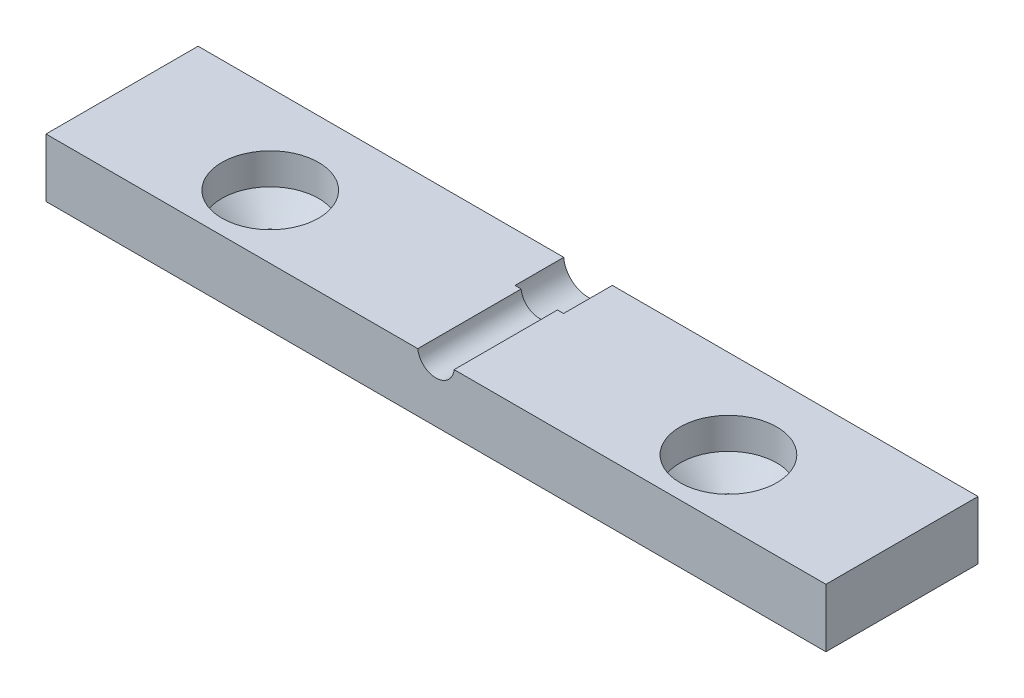
ISO-10303-21;
HEADER;
FILE_DESCRIPTION(('STEP AP214'),'2;1');
FILE_NAME('part.step','',(''),(''),'','','');
FILE_SCHEMA(('AUTOMOTIVE_DESIGN { 1 0 10303 214 1 1 1 1 }'));
ENDSEC;
DATA;
#1=APPLICATION_CONTEXT('core data for automotive mechanical design processes');
#2=APPLICATION_PROTOCOL_DEFINITION('international standard','automotive_design',2000,#1);
#3=PRODUCT_CONTEXT('',#1,'mechanical');
#4=PRODUCT('Part','Part','',(#3));
#5=PRODUCT_RELATED_PRODUCT_CATEGORY('part','',(#4));
#6=PRODUCT_DEFINITION_FORMATION('','',#4);
#7=PRODUCT_DEFINITION_CONTEXT('part definition',#1,'design');
#8=PRODUCT_DEFINITION('design','',#6,#7);
#9=PRODUCT_DEFINITION_SHAPE('','',#8);
#10=(LENGTH_UNIT() NAMED_UNIT(*) SI_UNIT(.MILLI.,.METRE.));
#11=(NAMED_UNIT(*) PLANE_ANGLE_UNIT() SI_UNIT($,.RADIAN.));
#12=(NAMED_UNIT(*) SI_UNIT($,.STERADIAN.) SOLID_ANGLE_UNIT());
#13=UNCERTAINTY_MEASURE_WITH_UNIT(LENGTH_MEASURE(1.E-05),#10,'distance_accuracy_value','');
#14=(GEOMETRIC_REPRESENTATION_CONTEXT(3) GLOBAL_UNCERTAINTY_ASSIGNED_CONTEXT((#13)) GLOBAL_UNIT_ASSIGNED_CONTEXT((#10,
#11,#12)) REPRESENTATION_CONTEXT('',''));
#15=CARTESIAN_POINT('',(0.,0.,0.));
#16=DIRECTION('',(0.,0.,1.));
#17=DIRECTION('',(1.,0.,0.));
#18=AXIS2_PLACEMENT_3D('',#15,#16,#17);
#19=CARTESIAN_POINT('',(0.,7.62,0.));
#20=DIRECTION('',(0.,1.,0.));
#21=DIRECTION('',(0.,0.,1.));
#22=AXIS2_PLACEMENT_3D('',#19,#20,#21);
#23=PLANE('',#22);
#24=DIRECTION('',(0.,0.,-1.));
#25=VECTOR('',#24,1.);
#26=CARTESIAN_POINT('',(2.36766457981277,7.62,9.90600000000001));
#27=LINE('',#26,#25);
#28=CARTESIAN_POINT('',(2.36766457981277,7.62,9.90600000000001));
#29=VERTEX_POINT('',#28);
#30=CARTESIAN_POINT('',(2.36766457981277,7.62,-3.556));
#31=VERTEX_POINT('',#30);
#32=EDGE_CURVE('E49',#29,#31,#27,.T.);
#33=ORIENTED_EDGE('',*,*,#32,.F.);
#34=DIRECTION('',(1.,0.,0.));
#35=VECTOR('',#34,1.);
#36=CARTESIAN_POINT('',(-50.8,7.62,9.90600000000001));
#37=LINE('',#36,#35);
#38=CARTESIAN_POINT('',(50.8,7.62000000000003,9.90599999999999));
#39=VERTEX_POINT('',#38);
#40=EDGE_CURVE('E111',#29,#39,#37,.T.);
#41=ORIENTED_EDGE('',*,*,#40,.T.);
#42=DIRECTION('',(0.,0.,-1.));
#43=VECTOR('',#42,1.);
#44=CARTESIAN_POINT('',(50.8,7.62,9.90599999999999));
#45=LINE('',#44,#43);
#46=CARTESIAN_POINT('',(50.8,7.62,-9.906));
#47=VERTEX_POINT('',#46);
#48=EDGE_CURVE('E122',#39,#47,#45,.T.);
#49=ORIENTED_EDGE('',*,*,#48,.T.);
#50=DIRECTION('',(-1.,0.,0.));
#51=VECTOR('',#50,1.);
#52=CARTESIAN_POINT('',(50.8,7.62,-9.90600000000001));
#53=LINE('',#52,#51);
#54=CARTESIAN_POINT('',(3.16482369177179,7.62,-9.906));
#55=VERTEX_POINT('',#54);
#56=EDGE_CURVE('E132',#47,#55,#53,.T.);
#57=ORIENTED_EDGE('',*,*,#56,.T.);
#58=DIRECTION('',(0.,0.,-1.));
#59=VECTOR('',#58,1.);
#60=CARTESIAN_POINT('',(3.16482369177179,7.62,-3.556));
#61=LINE('',#60,#59);
#62=CARTESIAN_POINT('',(3.16482369177179,7.62,-3.556));
#63=VERTEX_POINT('',#62);
#64=EDGE_CURVE('E43',#63,#55,#61,.T.);
#65=ORIENTED_EDGE('',*,*,#64,.F.);
#66=DIRECTION('',(-1.,0.,0.));
#67=VECTOR('',#66,1.);
#68=CARTESIAN_POINT('',(0.,7.62,-3.556));
#69=LINE('',#68,#67);
#70=EDGE_CURVE('E114',#63,#31,#69,.T.);
#71=ORIENTED_EDGE('',*,*,#70,.T.);
#72=EDGE_LOOP('',(#33,#41,#49,#57,#65,#71));
#73=FACE_BOUND('',#72,.T.);
#74=CARTESIAN_POINT('',(29.845,7.62,1.651));
#75=DIRECTION('',(0.,1.,0.));
#76=DIRECTION('',(0.,0.,1.));
#77=AXIS2_PLACEMENT_3D('',#74,#75,#76);
#78=CIRCLE('',#77,6.29999999999999);
#79=CARTESIAN_POINT('',(29.845,7.62,7.95099999999999));
#80=VERTEX_POINT('',#79);
#81=EDGE_CURVE('E136',#80,#80,#78,.T.);
#82=ORIENTED_EDGE('',*,*,#81,.F.);
#83=EDGE_LOOP('',(#82));
#84=FACE_BOUND('',#83,.T.);
#85=ADVANCED_FACE('F35',(#73,#84),#23,.T.);
#86=CARTESIAN_POINT('',(-50.8,3.81,9.90600000000001));
#87=DIRECTION('',(1.,0.,0.));
#88=DIRECTION('',(0.,0.,-1.));
#89=AXIS2_PLACEMENT_3D('',#86,#87,#88);
#90=PLANE('',#89);
#91=DIRECTION('',(0.,0.,1.));
#92=VECTOR('',#91,1.);
#93=CARTESIAN_POINT('',(-50.8,0.,9.90600000000001));
#94=LINE('',#93,#92);
#95=CARTESIAN_POINT('',(-50.8,0.,-9.906));
#96=VERTEX_POINT('',#95);
#97=CARTESIAN_POINT('',(-50.8,0.,9.90600000000001));
#98=VERTEX_POINT('',#97);
#99=EDGE_CURVE('E157',#96,#98,#94,.T.);
#100=ORIENTED_EDGE('',*,*,#99,.T.);
#101=DIRECTION('',(0.,-1.,0.));
#102=VECTOR('',#101,1.);
#103=CARTESIAN_POINT('',(-50.8,3.81,9.90600000000001));
#104=LINE('',#103,#102);
#105=CARTESIAN_POINT('',(-50.8,7.62000000000003,9.90600000000001));
#106=VERTEX_POINT('',#105);
#107=EDGE_CURVE('E173',#106,#98,#104,.T.);
#108=ORIENTED_EDGE('',*,*,#107,.F.);
#109=DIRECTION('',(0.,0.,1.));
#110=VECTOR('',#109,1.);
#111=CARTESIAN_POINT('',(-50.8,7.62,-9.906));
#112=LINE('',#111,#110);
#113=CARTESIAN_POINT('',(-50.8,7.62000000000003,-9.906));
#114=VERTEX_POINT('',#113);
#115=EDGE_CURVE('E124',#114,#106,#112,.T.);
#116=ORIENTED_EDGE('',*,*,#115,.F.);
#117=DIRECTION('',(0.,-1.,0.));
#118=VECTOR('',#117,1.);
#119=CARTESIAN_POINT('',(-50.8,3.81,-9.906));
#120=LINE('',#119,#118);
#121=EDGE_CURVE('E166',#114,#96,#120,.T.);
#122=ORIENTED_EDGE('',*,*,#121,.T.);
#123=EDGE_LOOP('',(#100,#108,#116,#122));
#124=FACE_BOUND('',#123,.T.);
#125=ADVANCED_FACE('F37',(#124),#90,.F.);
#126=CARTESIAN_POINT('',(50.8,3.81,9.90599999999999));
#127=DIRECTION('',(0.,0.,-1.));
#128=DIRECTION('',(-1.,0.,0.));
#129=AXIS2_PLACEMENT_3D('',#126,#127,#128);
#130=PLANE('',#129);
#131=ORIENTED_EDGE('',*,*,#40,.F.);
#132=CARTESIAN_POINT('',(0.,7.874,9.90600000000001));
#133=DIRECTION('',(0.,0.,-1.));
#134=DIRECTION('',(-1.,0.,0.));
#135=AXIS2_PLACEMENT_3D('',#132,#133,#134);
#136=CIRCLE('',#135,2.38125);
#137=CARTESIAN_POINT('',(-2.36766457981277,7.62,9.90600000000001));
#138=VERTEX_POINT('',#137);
#139=EDGE_CURVE('E99',#29,#138,#136,.T.);
#140=ORIENTED_EDGE('',*,*,#139,.T.);
#141=EDGE_CURVE('E121',#106,#138,#37,.T.);
#142=ORIENTED_EDGE('',*,*,#141,.F.);
#143=ORIENTED_EDGE('',*,*,#107,.T.);
#144=DIRECTION('',(1.,0.,0.));
#145=VECTOR('',#144,1.);
#146=CARTESIAN_POINT('',(50.8,0.,9.90599999999999));
#147=LINE('',#146,#145);
#148=CARTESIAN_POINT('',(50.8,0.,9.90599999999999));
#149=VERTEX_POINT('',#148);
#150=EDGE_CURVE('E160',#98,#149,#147,.T.);
#151=ORIENTED_EDGE('',*,*,#150,.T.);
#152=DIRECTION('',(0.,-1.,0.));
#153=VECTOR('',#152,1.);
#154=CARTESIAN_POINT('',(50.8,3.81,9.90599999999999));
#155=LINE('',#154,#153);
#156=EDGE_CURVE('E119',#39,#149,#155,.T.);
#157=ORIENTED_EDGE('',*,*,#156,.F.);
#158=EDGE_LOOP('',(#131,#140,#142,#143,#151,#157));
#159=FACE_BOUND('',#158,.T.);
#160=ADVANCED_FACE('F117',(#159),#130,.F.);
#161=CARTESIAN_POINT('',(50.8,3.81,9.90599999999999));
#162=DIRECTION('',(-1.,0.,0.));
#163=DIRECTION('',(0.,0.,1.));
#164=AXIS2_PLACEMENT_3D('',#161,#162,#163);
#165=PLANE('',#164);
#166=DIRECTION('',(0.,0.,-1.));
#167=VECTOR('',#166,1.);
#168=CARTESIAN_POINT('',(50.8,0.,9.90599999999999));
#169=LINE('',#168,#167);
#170=CARTESIAN_POINT('',(50.8,0.,-9.90600000000001));
#171=VERTEX_POINT('',#170);
#172=EDGE_CURVE('E162',#149,#171,#169,.T.);
#173=ORIENTED_EDGE('',*,*,#172,.T.);
#174=DIRECTION('',(0.,-1.,0.));
#175=VECTOR('',#174,1.);
#176=CARTESIAN_POINT('',(50.8,3.81,-9.90600000000001));
#177=LINE('',#176,#175);
#178=EDGE_CURVE('E169',#47,#171,#177,.T.);
#179=ORIENTED_EDGE('',*,*,#178,.F.);
#180=ORIENTED_EDGE('',*,*,#48,.F.);
#181=ORIENTED_EDGE('',*,*,#156,.T.);
#182=EDGE_LOOP('',(#173,#179,#180,#181));
#183=FACE_BOUND('',#182,.T.);
#184=ADVANCED_FACE('F190',(#183),#165,.F.);
#185=CARTESIAN_POINT('',(50.8,3.81,-9.90600000000001));
#186=DIRECTION('',(0.,0.,1.));
#187=DIRECTION('',(1.,0.,0.));
#188=AXIS2_PLACEMENT_3D('',#185,#186,#187);
#189=PLANE('',#188);
#190=CARTESIAN_POINT('',(-3.16482369177179,7.62,-9.906));
#191=VERTEX_POINT('',#190);
#192=EDGE_CURVE('E131',#191,#114,#53,.T.);
#193=ORIENTED_EDGE('',*,*,#192,.F.);
#194=CARTESIAN_POINT('',(0.,7.874,-9.906));
#195=DIRECTION('',(0.,0.,-1.));
#196=DIRECTION('',(-1.,0.,0.));
#197=AXIS2_PLACEMENT_3D('',#194,#195,#196);
#198=CIRCLE('',#197,3.175);
#199=EDGE_CURVE('E115',#55,#191,#198,.T.);
#200=ORIENTED_EDGE('',*,*,#199,.F.);
#201=ORIENTED_EDGE('',*,*,#56,.F.);
#202=ORIENTED_EDGE('',*,*,#178,.T.);
#203=DIRECTION('',(-1.,0.,0.));
#204=VECTOR('',#203,1.);
#205=CARTESIAN_POINT('',(50.8,0.,-9.90600000000001));
#206=LINE('',#205,#204);
#207=EDGE_CURVE('E164',#171,#96,#206,.T.);
#208=ORIENTED_EDGE('',*,*,#207,.T.);
#209=ORIENTED_EDGE('',*,*,#121,.F.);
#210=EDGE_LOOP('',(#193,#200,#201,#202,#208,#209));
#211=FACE_BOUND('',#210,.T.);
#212=ADVANCED_FACE('F186',(#211),#189,.F.);
#213=CARTESIAN_POINT('',(0.,0.,0.));
#214=DIRECTION('',(0.,1.,0.));
#215=DIRECTION('',(0.,0.,1.));
#216=AXIS2_PLACEMENT_3D('',#213,#214,#215);
#217=PLANE('',#216);
#218=CARTESIAN_POINT('',(-29.845,0.,1.651));
#219=DIRECTION('',(0.,1.,0.));
#220=DIRECTION('',(0.,0.,1.));
#221=AXIS2_PLACEMENT_3D('',#218,#219,#220);
#222=CIRCLE('',#221,3.50000000000001);
#223=CARTESIAN_POINT('',(-29.845,0.,5.15100000000001));
#224=VERTEX_POINT('',#223);
#225=EDGE_CURVE('E145',#224,#224,#222,.T.);
#226=ORIENTED_EDGE('',*,*,#225,.T.);
#227=EDGE_LOOP('',(#226));
#228=FACE_BOUND('',#227,.T.);
#229=CARTESIAN_POINT('',(29.845,0.,1.651));
#230=DIRECTION('',(0.,1.,0.));
#231=DIRECTION('',(0.,0.,1.));
#232=AXIS2_PLACEMENT_3D('',#229,#230,#231);
#233=CIRCLE('',#232,3.50000000000001);
#234=CARTESIAN_POINT('',(29.845,0.,5.15100000000001));
#235=VERTEX_POINT('',#234);
#236=EDGE_CURVE('E154',#235,#235,#233,.T.);
#237=ORIENTED_EDGE('',*,*,#236,.T.);
#238=EDGE_LOOP('',(#237));
#239=FACE_BOUND('',#238,.T.);
#240=ORIENTED_EDGE('',*,*,#99,.F.);
#241=ORIENTED_EDGE('',*,*,#207,.F.);
#242=ORIENTED_EDGE('',*,*,#172,.F.);
#243=ORIENTED_EDGE('',*,*,#150,.F.);
#244=EDGE_LOOP('',(#240,#241,#242,#243));
#245=FACE_BOUND('',#244,.T.);
#246=ADVANCED_FACE('F195',(#228,#239,#245),#217,.F.);
#247=CARTESIAN_POINT('',(29.845,3.81,1.651));
#248=DIRECTION('',(0.,1.,0.));
#249=DIRECTION('',(0.,0.,1.));
#250=AXIS2_PLACEMENT_3D('',#247,#248,#249);
#251=CYLINDRICAL_SURFACE('',#250,3.50000000000001);
#252=ORIENTED_EDGE('',*,*,#236,.F.);
#253=EDGE_LOOP('',(#252));
#254=FACE_BOUND('',#253,.T.);
#255=CARTESIAN_POINT('',(29.845,0.756,1.651));
#256=DIRECTION('',(0.,1.,0.));
#257=DIRECTION('',(0.,0.,1.));
#258=AXIS2_PLACEMENT_3D('',#255,#256,#257);
#259=CIRCLE('',#258,3.5);
#260=CARTESIAN_POINT('',(29.845,0.756,5.151));
#261=VERTEX_POINT('',#260);
#262=EDGE_CURVE('E151',#261,#261,#259,.T.);
#263=ORIENTED_EDGE('',*,*,#262,.T.);
#264=EDGE_LOOP('',(#263));
#265=FACE_BOUND('',#264,.T.);
#266=ADVANCED_FACE('F234',(#254,#265),#251,.F.);
#267=CARTESIAN_POINT('',(29.845,3.556,1.651));
#268=DIRECTION('',(0.,1.,0.));
#269=DIRECTION('',(0.,0.,1.));
#270=AXIS2_PLACEMENT_3D('',#267,#268,#269);
#271=CONICAL_SURFACE('',#270,6.3,0.785398163397448);
#272=ORIENTED_EDGE('',*,*,#262,.F.);
#273=EDGE_LOOP('',(#272));
#274=FACE_BOUND('',#273,.T.);
#275=CARTESIAN_POINT('',(29.845,3.556,1.651));
#276=DIRECTION('',(0.,1.,0.));
#277=DIRECTION('',(0.,0.,1.));
#278=AXIS2_PLACEMENT_3D('',#275,#276,#277);
#279=CIRCLE('',#278,6.3);
#280=CARTESIAN_POINT('',(29.845,3.556,7.95099999999999));
#281=VERTEX_POINT('',#280);
#282=EDGE_CURVE('E148',#281,#281,#279,.T.);
#283=ORIENTED_EDGE('',*,*,#282,.T.);
#284=EDGE_LOOP('',(#283));
#285=FACE_BOUND('',#284,.T.);
#286=ADVANCED_FACE('F238',(#274,#285),#271,.F.);
#287=CARTESIAN_POINT('',(29.845,3.81,1.651));
#288=DIRECTION('',(0.,1.,0.));
#289=DIRECTION('',(0.,0.,1.));
#290=AXIS2_PLACEMENT_3D('',#287,#288,#289);
#291=CYLINDRICAL_SURFACE('',#290,6.3);
#292=ORIENTED_EDGE('',*,*,#282,.F.);
#293=EDGE_LOOP('',(#292));
#294=FACE_BOUND('',#293,.T.);
#295=ORIENTED_EDGE('',*,*,#81,.T.);
#296=EDGE_LOOP('',(#295));
#297=FACE_BOUND('',#296,.T.);
#298=ADVANCED_FACE('F242',(#294,#297),#291,.F.);
#299=CARTESIAN_POINT('',(-29.845,3.81,1.651));
#300=DIRECTION('',(0.,1.,0.));
#301=DIRECTION('',(0.,0.,1.));
#302=AXIS2_PLACEMENT_3D('',#299,#300,#301);
#303=CYLINDRICAL_SURFACE('',#302,3.5);
#304=ORIENTED_EDGE('',*,*,#225,.F.);
#305=EDGE_LOOP('',(#304));
#306=FACE_BOUND('',#305,.T.);
#307=CARTESIAN_POINT('',(-29.845,0.756,1.651));
#308=DIRECTION('',(0.,1.,0.));
#309=DIRECTION('',(0.,0.,1.));
#310=AXIS2_PLACEMENT_3D('',#307,#308,#309);
#311=CIRCLE('',#310,3.5);
#312=CARTESIAN_POINT('',(-29.845,0.756,5.151));
#313=VERTEX_POINT('',#312);
#314=EDGE_CURVE('E142',#313,#313,#311,.T.);
#315=ORIENTED_EDGE('',*,*,#314,.T.);
#316=EDGE_LOOP('',(#315));
#317=FACE_BOUND('',#316,.T.);
#318=ADVANCED_FACE('F246',(#306,#317),#303,.F.);
#319=CARTESIAN_POINT('',(-29.845,3.556,1.651));
#320=DIRECTION('',(0.,1.,0.));
#321=DIRECTION('',(0.,0.,1.));
#322=AXIS2_PLACEMENT_3D('',#319,#320,#321);
#323=CONICAL_SURFACE('',#322,6.3,0.785398163397449);
#324=ORIENTED_EDGE('',*,*,#314,.F.);
#325=EDGE_LOOP('',(#324));
#326=FACE_BOUND('',#325,.T.);
#327=CARTESIAN_POINT('',(-29.845,3.556,1.651));
#328=DIRECTION('',(0.,1.,0.));
#329=DIRECTION('',(0.,0.,1.));
#330=AXIS2_PLACEMENT_3D('',#327,#328,#329);
#331=CIRCLE('',#330,6.3);
#332=CARTESIAN_POINT('',(-29.845,3.556,7.951));
#333=VERTEX_POINT('',#332);
#334=EDGE_CURVE('E135',#333,#333,#331,.T.);
#335=ORIENTED_EDGE('',*,*,#334,.T.);
#336=EDGE_LOOP('',(#335));
#337=FACE_BOUND('',#336,.T.);
#338=ADVANCED_FACE('F215',(#326,#337),#323,.F.);
#339=CARTESIAN_POINT('',(-29.845,3.81,1.651));
#340=DIRECTION('',(0.,1.,0.));
#341=DIRECTION('',(0.,0.,1.));
#342=AXIS2_PLACEMENT_3D('',#339,#340,#341);
#343=CYLINDRICAL_SURFACE('',#342,6.3);
#344=ORIENTED_EDGE('',*,*,#334,.F.);
#345=EDGE_LOOP('',(#344));
#346=FACE_BOUND('',#345,.T.);
#347=CARTESIAN_POINT('',(-29.845,7.62,1.651));
#348=DIRECTION('',(0.,1.,0.));
#349=DIRECTION('',(0.,0.,1.));
#350=AXIS2_PLACEMENT_3D('',#347,#348,#349);
#351=CIRCLE('',#350,6.3);
#352=CARTESIAN_POINT('',(-29.845,7.62,7.95100000000001));
#353=VERTEX_POINT('',#352);
#354=EDGE_CURVE('E125',#353,#353,#351,.T.);
#355=ORIENTED_EDGE('',*,*,#354,.T.);
#356=EDGE_LOOP('',(#355));
#357=FACE_BOUND('',#356,.T.);
#358=ADVANCED_FACE('F207',(#346,#357),#343,.F.);
#359=DIRECTION('',(0.,0.,-1.));
#360=VECTOR('',#359,1.);
#361=CARTESIAN_POINT('',(-2.36766457981277,7.62,9.90600000000001));
#362=LINE('',#361,#360);
#363=CARTESIAN_POINT('',(-2.36766457981277,7.62,-3.556));
#364=VERTEX_POINT('',#363);
#365=EDGE_CURVE('E101',#364,#138,#362,.F.);
#366=ORIENTED_EDGE('',*,*,#365,.F.);
#367=CARTESIAN_POINT('',(-3.16482369177179,7.62,-3.556));
#368=VERTEX_POINT('',#367);
#369=EDGE_CURVE('E57',#364,#368,#69,.T.);
#370=ORIENTED_EDGE('',*,*,#369,.T.);
#371=DIRECTION('',(0.,0.,-1.));
#372=VECTOR('',#371,1.);
#373=CARTESIAN_POINT('',(-3.16482369177179,7.62,-3.556));
#374=LINE('',#373,#372);
#375=EDGE_CURVE('E177',#191,#368,#374,.F.);
#376=ORIENTED_EDGE('',*,*,#375,.F.);
#377=ORIENTED_EDGE('',*,*,#192,.T.);
#378=ORIENTED_EDGE('',*,*,#115,.T.);
#379=ORIENTED_EDGE('',*,*,#141,.T.);
#380=EDGE_LOOP('',(#366,#370,#376,#377,#378,#379));
#381=FACE_BOUND('',#380,.T.);
#382=ORIENTED_EDGE('',*,*,#354,.F.);
#383=EDGE_LOOP('',(#382));
#384=FACE_BOUND('',#383,.T.);
#385=ADVANCED_FACE('F198',(#381,#384),#23,.T.);
#386=CARTESIAN_POINT('',(0.,7.874,-3.556));
#387=DIRECTION('',(0.,0.,-1.));
#388=DIRECTION('',(-1.,0.,0.));
#389=AXIS2_PLACEMENT_3D('',#386,#387,#388);
#390=CYLINDRICAL_SURFACE('',#389,3.175);
#391=ORIENTED_EDGE('',*,*,#64,.T.);
#392=ORIENTED_EDGE('',*,*,#199,.T.);
#393=ORIENTED_EDGE('',*,*,#375,.T.);
#394=CARTESIAN_POINT('',(0.,7.874,-3.556));
#395=DIRECTION('',(0.,0.,-1.));
#396=DIRECTION('',(-1.,0.,0.));
#397=AXIS2_PLACEMENT_3D('',#394,#395,#396);
#398=CIRCLE('',#397,3.175);
#399=EDGE_CURVE('E139',#63,#368,#398,.T.);
#400=ORIENTED_EDGE('',*,*,#399,.F.);
#401=EDGE_LOOP('',(#391,#392,#393,#400));
#402=FACE_BOUND('',#401,.T.);
#403=ADVANCED_FACE('F182',(#402),#390,.F.);
#404=CARTESIAN_POINT('',(0.,7.874,-3.556));
#405=DIRECTION('',(0.,0.,-1.));
#406=DIRECTION('',(-1.,0.,0.));
#407=AXIS2_PLACEMENT_3D('',#404,#405,#406);
#408=PLANE('',#407);
#409=CARTESIAN_POINT('',(0.,7.874,-3.556));
#410=DIRECTION('',(0.,0.,-1.));
#411=DIRECTION('',(-1.,0.,0.));
#412=AXIS2_PLACEMENT_3D('',#409,#410,#411);
#413=CIRCLE('',#412,2.38125);
#414=EDGE_CURVE('E12',#31,#364,#413,.T.);
#415=ORIENTED_EDGE('',*,*,#414,.F.);
#416=ORIENTED_EDGE('',*,*,#70,.F.);
#417=ORIENTED_EDGE('',*,*,#399,.T.);
#418=ORIENTED_EDGE('',*,*,#369,.F.);
#419=EDGE_LOOP('',(#415,#416,#417,#418));
#420=FACE_BOUND('',#419,.T.);
#421=ADVANCED_FACE('F202',(#420),#408,.T.);
#422=CARTESIAN_POINT('',(0.,7.874,9.90600000000001));
#423=DIRECTION('',(0.,0.,-1.));
#424=DIRECTION('',(-1.,0.,0.));
#425=AXIS2_PLACEMENT_3D('',#422,#423,#424);
#426=CYLINDRICAL_SURFACE('',#425,2.38125);
#427=ORIENTED_EDGE('',*,*,#32,.T.);
#428=ORIENTED_EDGE('',*,*,#414,.T.);
#429=ORIENTED_EDGE('',*,*,#365,.T.);
#430=ORIENTED_EDGE('',*,*,#139,.F.);
#431=EDGE_LOOP('',(#427,#428,#429,#430));
#432=FACE_BOUND('',#431,.T.);
#433=ADVANCED_FACE('F100',(#432),#426,.F.);
#434=CLOSED_SHELL('',(#85,#125,#160,#184,#212,#246,#266,#286,#298,#318,#338,#358,#385,#403,#421,#433));
#435=MANIFOLD_SOLID_BREP('B2',#434);
#436=ADVANCED_BREP_SHAPE_REPRESENTATION('',(#18,#435),#14);
#437=SHAPE_DEFINITION_REPRESENTATION(#9,#436);
ENDSEC;
END-ISO-10303-21;
